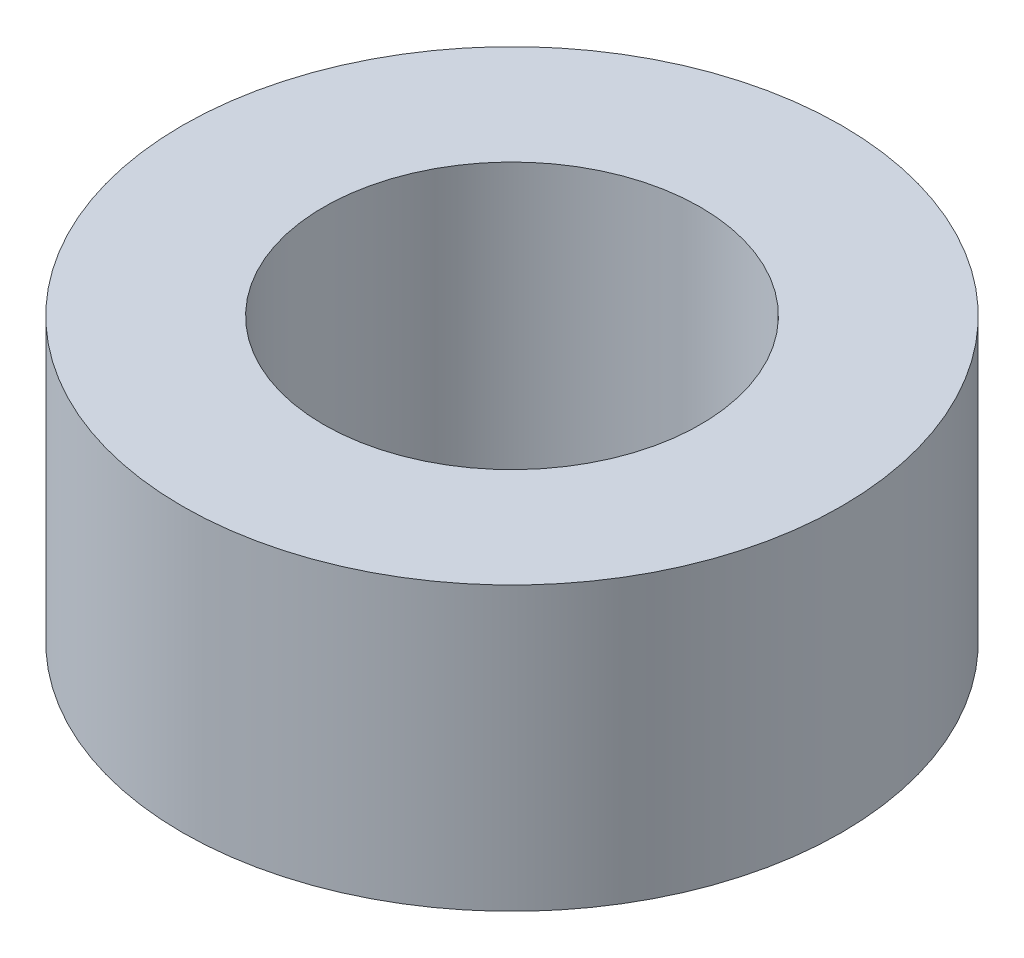
ISO-10303-21;
HEADER;
FILE_DESCRIPTION(('STEP AP214'),'2;1');
FILE_NAME('part.step','',(''),(''),'','','');
FILE_SCHEMA(('AUTOMOTIVE_DESIGN { 1 0 10303 214 1 1 1 1 }'));
ENDSEC;
DATA;
#1=APPLICATION_CONTEXT('core data for automotive mechanical design processes');
#2=APPLICATION_PROTOCOL_DEFINITION('international standard','automotive_design',2000,#1);
#3=PRODUCT_CONTEXT('',#1,'mechanical');
#4=PRODUCT('Part','Part','',(#3));
#5=PRODUCT_RELATED_PRODUCT_CATEGORY('part','',(#4));
#6=PRODUCT_DEFINITION_FORMATION('','',#4);
#7=PRODUCT_DEFINITION_CONTEXT('part definition',#1,'design');
#8=PRODUCT_DEFINITION('design','',#6,#7);
#9=PRODUCT_DEFINITION_SHAPE('','',#8);
#10=(LENGTH_UNIT() NAMED_UNIT(*) SI_UNIT(.MILLI.,.METRE.));
#11=(NAMED_UNIT(*) PLANE_ANGLE_UNIT() SI_UNIT($,.RADIAN.));
#12=(NAMED_UNIT(*) SI_UNIT($,.STERADIAN.) SOLID_ANGLE_UNIT());
#13=UNCERTAINTY_MEASURE_WITH_UNIT(LENGTH_MEASURE(1.E-05),#10,'distance_accuracy_value','');
#14=(GEOMETRIC_REPRESENTATION_CONTEXT(3) GLOBAL_UNCERTAINTY_ASSIGNED_CONTEXT((#13)) GLOBAL_UNIT_ASSIGNED_CONTEXT((#10,
#11,#12)) REPRESENTATION_CONTEXT('',''));
#15=CARTESIAN_POINT('',(0.,0.,0.));
#16=DIRECTION('',(0.,0.,1.));
#17=DIRECTION('',(1.,0.,0.));
#18=AXIS2_PLACEMENT_3D('',#15,#16,#17);
#19=CARTESIAN_POINT('',(0.,3.,0.));
#20=DIRECTION('',(0.,1.,0.));
#21=DIRECTION('',(0.,0.,1.));
#22=AXIS2_PLACEMENT_3D('',#19,#20,#21);
#23=PLANE('',#22);
#24=CARTESIAN_POINT('',(0.,3.,0.));
#25=DIRECTION('',(0.,1.,0.));
#26=DIRECTION('',(0.,0.,1.));
#27=AXIS2_PLACEMENT_3D('',#24,#25,#26);
#28=CIRCLE('',#27,3.5);
#29=CARTESIAN_POINT('',(0.,3.,3.5));
#30=VERTEX_POINT('',#29);
#31=EDGE_CURVE('E10',#30,#30,#28,.T.);
#32=ORIENTED_EDGE('',*,*,#31,.T.);
#33=EDGE_LOOP('',(#32));
#34=FACE_BOUND('',#33,.T.);
#35=CARTESIAN_POINT('',(0.,3.,0.));
#36=DIRECTION('',(0.,1.,0.));
#37=DIRECTION('',(0.,0.,1.));
#38=AXIS2_PLACEMENT_3D('',#35,#36,#37);
#39=CIRCLE('',#38,2.);
#40=CARTESIAN_POINT('',(0.,3.,2.));
#41=VERTEX_POINT('',#40);
#42=EDGE_CURVE('E42',#41,#41,#39,.T.);
#43=ORIENTED_EDGE('',*,*,#42,.F.);
#44=EDGE_LOOP('',(#43));
#45=FACE_BOUND('',#44,.T.);
#46=ADVANCED_FACE('F31',(#34,#45),#23,.T.);
#47=CARTESIAN_POINT('',(0.,0.,0.));
#48=DIRECTION('',(0.,1.,0.));
#49=DIRECTION('',(0.,0.,1.));
#50=AXIS2_PLACEMENT_3D('',#47,#48,#49);
#51=PLANE('',#50);
#52=CARTESIAN_POINT('',(0.,0.,0.));
#53=DIRECTION('',(0.,1.,0.));
#54=DIRECTION('',(0.,0.,1.));
#55=AXIS2_PLACEMENT_3D('',#52,#53,#54);
#56=CIRCLE('',#55,3.5);
#57=CARTESIAN_POINT('',(0.,0.,3.5));
#58=VERTEX_POINT('',#57);
#59=EDGE_CURVE('E35',#58,#58,#56,.T.);
#60=ORIENTED_EDGE('',*,*,#59,.F.);
#61=EDGE_LOOP('',(#60));
#62=FACE_BOUND('',#61,.T.);
#63=CARTESIAN_POINT('',(0.,0.,0.));
#64=DIRECTION('',(0.,1.,0.));
#65=DIRECTION('',(0.,0.,1.));
#66=AXIS2_PLACEMENT_3D('',#63,#64,#65);
#67=CIRCLE('',#66,2.);
#68=CARTESIAN_POINT('',(0.,0.,2.));
#69=VERTEX_POINT('',#68);
#70=EDGE_CURVE('E44',#69,#69,#67,.T.);
#71=ORIENTED_EDGE('',*,*,#70,.T.);
#72=EDGE_LOOP('',(#71));
#73=FACE_BOUND('',#72,.T.);
#74=ADVANCED_FACE('F54',(#62,#73),#51,.F.);
#75=CARTESIAN_POINT('',(0.,3.,0.));
#76=DIRECTION('',(0.,-1.,0.));
#77=DIRECTION('',(0.,0.,-1.));
#78=AXIS2_PLACEMENT_3D('',#75,#76,#77);
#79=CYLINDRICAL_SURFACE('',#78,3.5);
#80=ORIENTED_EDGE('',*,*,#31,.F.);
#81=EDGE_LOOP('',(#80));
#82=FACE_BOUND('',#81,.T.);
#83=ORIENTED_EDGE('',*,*,#59,.T.);
#84=EDGE_LOOP('',(#83));
#85=FACE_BOUND('',#84,.T.);
#86=ADVANCED_FACE('F33',(#82,#85),#79,.T.);
#87=CARTESIAN_POINT('',(0.,3.,0.));
#88=DIRECTION('',(0.,-1.,0.));
#89=DIRECTION('',(0.,0.,-1.));
#90=AXIS2_PLACEMENT_3D('',#87,#88,#89);
#91=CYLINDRICAL_SURFACE('',#90,2.);
#92=ORIENTED_EDGE('',*,*,#42,.T.);
#93=EDGE_LOOP('',(#92));
#94=FACE_BOUND('',#93,.T.);
#95=ORIENTED_EDGE('',*,*,#70,.F.);
#96=EDGE_LOOP('',(#95));
#97=FACE_BOUND('',#96,.T.);
#98=ADVANCED_FACE('F50',(#94,#97),#91,.F.);
#99=CLOSED_SHELL('',(#46,#74,#86,#98));
#100=MANIFOLD_SOLID_BREP('B2',#99);
#101=ADVANCED_BREP_SHAPE_REPRESENTATION('',(#18,#100),#14);
#102=SHAPE_DEFINITION_REPRESENTATION(#9,#101);
ENDSEC;
END-ISO-10303-21;
